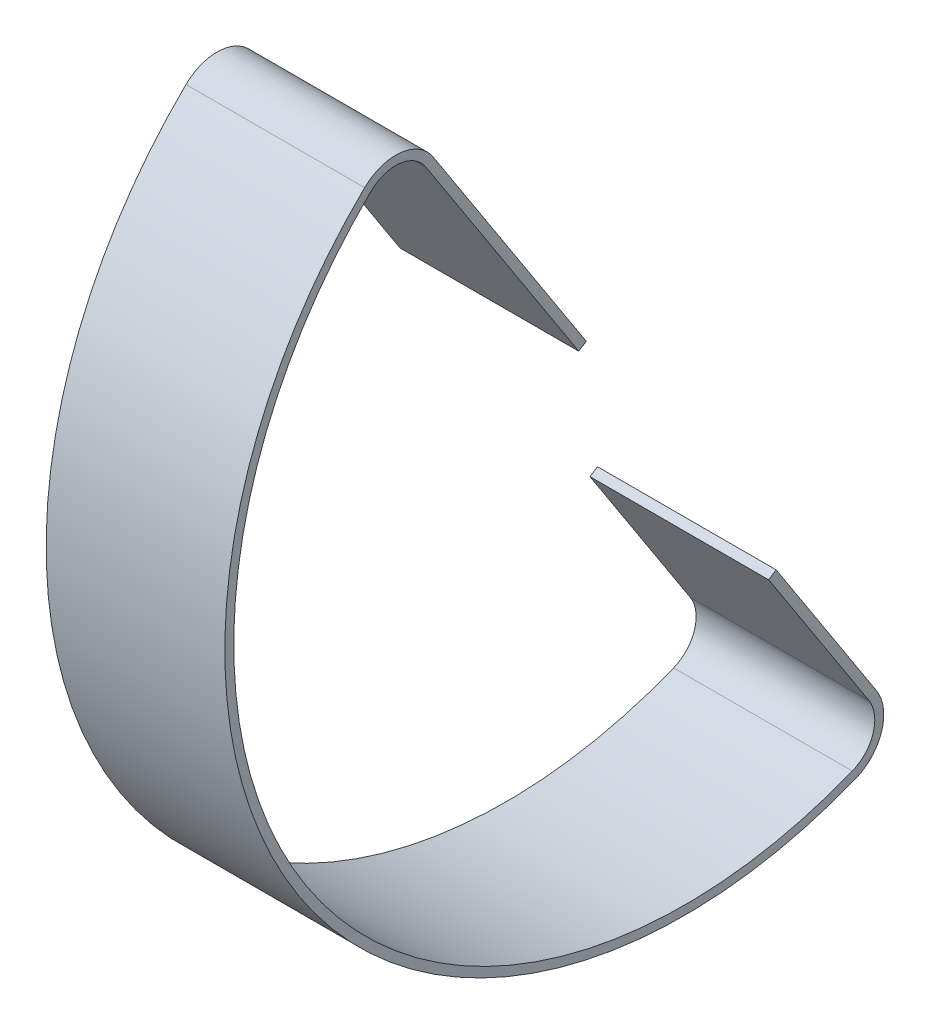
ISO-10303-21;
HEADER;
FILE_DESCRIPTION(('STEP AP214'),'2;1');
FILE_NAME('part.step','',(''),(''),'','','');
FILE_SCHEMA(('AUTOMOTIVE_DESIGN { 1 0 10303 214 1 1 1 1 }'));
ENDSEC;
DATA;
#1=APPLICATION_CONTEXT('core data for automotive mechanical design processes');
#2=APPLICATION_PROTOCOL_DEFINITION('international standard','automotive_design',2000,#1);
#3=PRODUCT_CONTEXT('',#1,'mechanical');
#4=PRODUCT('Part','Part','',(#3));
#5=PRODUCT_RELATED_PRODUCT_CATEGORY('part','',(#4));
#6=PRODUCT_DEFINITION_FORMATION('','',#4);
#7=PRODUCT_DEFINITION_CONTEXT('part definition',#1,'design');
#8=PRODUCT_DEFINITION('design','',#6,#7);
#9=PRODUCT_DEFINITION_SHAPE('','',#8);
#10=(LENGTH_UNIT() NAMED_UNIT(*) SI_UNIT(.MILLI.,.METRE.));
#11=(NAMED_UNIT(*) PLANE_ANGLE_UNIT() SI_UNIT($,.RADIAN.));
#12=(NAMED_UNIT(*) SI_UNIT($,.STERADIAN.) SOLID_ANGLE_UNIT());
#13=UNCERTAINTY_MEASURE_WITH_UNIT(LENGTH_MEASURE(1.E-05),#10,'distance_accuracy_value','');
#14=(GEOMETRIC_REPRESENTATION_CONTEXT(3) GLOBAL_UNCERTAINTY_ASSIGNED_CONTEXT((#13)) GLOBAL_UNIT_ASSIGNED_CONTEXT((#10,
#11,#12)) REPRESENTATION_CONTEXT('',''));
#15=CARTESIAN_POINT('',(0.,0.,0.));
#16=DIRECTION('',(0.,0.,1.));
#17=DIRECTION('',(1.,0.,0.));
#18=AXIS2_PLACEMENT_3D('',#15,#16,#17);
#19=CARTESIAN_POINT('',(2006.6,149.886108079532,-218.334745744563));
#20=DIRECTION('',(0.,0.543974891923004,-0.839101493835732));
#21=DIRECTION('',(0.,0.839101493835732,0.543974891923004));
#22=AXIS2_PLACEMENT_3D('',#19,#20,#21);
#23=PLANE('',#22);
#24=DIRECTION('',(0.,-0.839101493835732,-0.543974891923004));
#25=VECTOR('',#24,1.);
#26=CARTESIAN_POINT('',(1955.8,149.886108079532,-218.334745744563));
#27=LINE('',#26,#25);
#28=CARTESIAN_POINT('',(1955.8,217.012893904773,-174.8176189933));
#29=VERTEX_POINT('',#28);
#30=CARTESIAN_POINT('',(1955.8,149.886108079532,-218.334745744563));
#31=VERTEX_POINT('',#30);
#32=EDGE_CURVE('E161',#29,#31,#27,.T.);
#33=ORIENTED_EDGE('',*,*,#32,.T.);
#34=DIRECTION('',(-1.,0.,0.));
#35=VECTOR('',#34,1.);
#36=CARTESIAN_POINT('',(2006.6,149.886108079532,-218.334745744563));
#37=LINE('',#36,#35);
#38=CARTESIAN_POINT('',(2006.6,149.886108079532,-218.334745744563));
#39=VERTEX_POINT('',#38);
#40=EDGE_CURVE('E11',#39,#31,#37,.T.);
#41=ORIENTED_EDGE('',*,*,#40,.F.);
#42=DIRECTION('',(0.,-0.839101493835732,-0.543974891923004));
#43=VECTOR('',#42,1.);
#44=CARTESIAN_POINT('',(2006.6,149.886108079532,-218.334745744563));
#45=LINE('',#44,#43);
#46=CARTESIAN_POINT('',(2006.6,217.012893904773,-174.8176189933));
#47=VERTEX_POINT('',#46);
#48=EDGE_CURVE('E109',#47,#39,#45,.T.);
#49=ORIENTED_EDGE('',*,*,#48,.F.);
#50=DIRECTION('',(-1.,0.,0.));
#51=VECTOR('',#50,1.);
#52=CARTESIAN_POINT('',(2006.6,217.012893904773,-174.8176189933));
#53=LINE('',#52,#51);
#54=EDGE_CURVE('E157',#47,#29,#53,.T.);
#55=ORIENTED_EDGE('',*,*,#54,.T.);
#56=EDGE_LOOP('',(#33,#41,#49,#55));
#57=FACE_BOUND('',#56,.T.);
#58=ADVANCED_FACE('F41',(#57),#23,.F.);
#59=CARTESIAN_POINT('',(2006.6,151.267804305016,-220.466063538906));
#60=DIRECTION('',(0.,-0.839101493835732,-0.543974891923003));
#61=DIRECTION('',(0.,0.543974891923004,-0.839101493835732));
#62=AXIS2_PLACEMENT_3D('',#59,#60,#61);
#63=PLANE('',#62);
#64=DIRECTION('',(0.,-0.543974891923004,0.839101493835732));
#65=VECTOR('',#64,1.);
#66=CARTESIAN_POINT('',(1955.8,151.267804305016,-220.466063538906));
#67=LINE('',#66,#65);
#68=CARTESIAN_POINT('',(1955.8,151.267804305016,-220.466063538906));
#69=VERTEX_POINT('',#68);
#70=EDGE_CURVE('E164',#69,#31,#67,.T.);
#71=ORIENTED_EDGE('',*,*,#70,.F.);
#72=DIRECTION('',(-1.,0.,0.));
#73=VECTOR('',#72,1.);
#74=CARTESIAN_POINT('',(2006.6,151.267804305016,-220.466063538906));
#75=LINE('',#74,#73);
#76=CARTESIAN_POINT('',(2006.6,151.267804305016,-220.466063538906));
#77=VERTEX_POINT('',#76);
#78=EDGE_CURVE('E49',#77,#69,#75,.T.);
#79=ORIENTED_EDGE('',*,*,#78,.F.);
#80=DIRECTION('',(0.,-0.543974891923004,0.839101493835732));
#81=VECTOR('',#80,1.);
#82=CARTESIAN_POINT('',(2006.6,151.267804305016,-220.466063538906));
#83=LINE('',#82,#81);
#84=EDGE_CURVE('E226',#77,#39,#83,.T.);
#85=ORIENTED_EDGE('',*,*,#84,.T.);
#86=ORIENTED_EDGE('',*,*,#40,.T.);
#87=EDGE_LOOP('',(#71,#79,#85,#86));
#88=FACE_BOUND('',#87,.T.);
#89=ADVANCED_FACE('F213',(#88),#63,.T.);
#90=CARTESIAN_POINT('',(2006.6,151.267804305016,-220.466063538906));
#91=DIRECTION('',(0.,0.543974891923003,-0.839101493835732));
#92=DIRECTION('',(0.,0.839101493835732,0.543974891923004));
#93=AXIS2_PLACEMENT_3D('',#90,#91,#92);
#94=PLANE('',#93);
#95=DIRECTION('',(0.,-0.839101493835732,-0.543974891923004));
#96=VECTOR('',#95,1.);
#97=CARTESIAN_POINT('',(1955.8,151.267804305016,-220.466063538906));
#98=LINE('',#97,#96);
#99=CARTESIAN_POINT('',(1955.8,218.394590130257,-176.948936787643));
#100=VERTEX_POINT('',#99);
#101=EDGE_CURVE('E167',#100,#69,#98,.T.);
#102=ORIENTED_EDGE('',*,*,#101,.F.);
#103=DIRECTION('',(-1.,0.,0.));
#104=VECTOR('',#103,1.);
#105=CARTESIAN_POINT('',(2006.6,218.394590130257,-176.948936787643));
#106=LINE('',#105,#104);
#107=CARTESIAN_POINT('',(2006.6,218.394590130257,-176.948936787643));
#108=VERTEX_POINT('',#107);
#109=EDGE_CURVE('E203',#108,#100,#106,.T.);
#110=ORIENTED_EDGE('',*,*,#109,.F.);
#111=DIRECTION('',(0.,-0.839101493835732,-0.543974891923004));
#112=VECTOR('',#111,1.);
#113=CARTESIAN_POINT('',(2006.6,151.267804305016,-220.466063538906));
#114=LINE('',#113,#112);
#115=EDGE_CURVE('E210',#108,#77,#114,.T.);
#116=ORIENTED_EDGE('',*,*,#115,.T.);
#117=ORIENTED_EDGE('',*,*,#78,.T.);
#118=EDGE_LOOP('',(#102,#110,#116,#117));
#119=FACE_BOUND('',#118,.T.);
#120=ADVANCED_FACE('F208',(#119),#94,.T.);
#121=CARTESIAN_POINT('',(2006.6,211.486109002835,-166.292347815929));
#122=DIRECTION('',(-1.,0.,0.));
#123=DIRECTION('',(0.,0.,1.));
#124=AXIS2_PLACEMENT_3D('',#121,#122,#123);
#125=CYLINDRICAL_SURFACE('',#124,12.7);
#126=CARTESIAN_POINT('',(1955.8,211.486109002835,-166.292347815929));
#127=DIRECTION('',(-1.,0.,0.));
#128=DIRECTION('',(0.,0.,-1.));
#129=AXIS2_PLACEMENT_3D('',#126,#127,#128);
#130=CIRCLE('',#129,12.7);
#131=CARTESIAN_POINT('',(1955.8,220.604709470289,-157.452600901286));
#132=VERTEX_POINT('',#131);
#133=EDGE_CURVE('E170',#132,#100,#130,.T.);
#134=ORIENTED_EDGE('',*,*,#133,.F.);
#135=DIRECTION('',(-1.,0.,0.));
#136=VECTOR('',#135,1.);
#137=CARTESIAN_POINT('',(2006.6,220.604709470289,-157.452600901286));
#138=LINE('',#137,#136);
#139=CARTESIAN_POINT('',(2006.6,220.604709470289,-157.452600901286));
#140=VERTEX_POINT('',#139);
#141=EDGE_CURVE('E201',#140,#132,#138,.T.);
#142=ORIENTED_EDGE('',*,*,#141,.F.);
#143=CARTESIAN_POINT('',(2006.6,211.486109002835,-166.292347815929));
#144=DIRECTION('',(-1.,0.,0.));
#145=DIRECTION('',(0.,0.,-1.));
#146=AXIS2_PLACEMENT_3D('',#143,#144,#145);
#147=CIRCLE('',#146,12.7);
#148=EDGE_CURVE('E223',#140,#108,#147,.T.);
#149=ORIENTED_EDGE('',*,*,#148,.T.);
#150=ORIENTED_EDGE('',*,*,#109,.T.);
#151=EDGE_LOOP('',(#134,#142,#149,#150));
#152=FACE_BOUND('',#151,.T.);
#153=ADVANCED_FACE('F220',(#152),#125,.T.);
#154=CARTESIAN_POINT('',(2006.6,126.694324041268,-248.49113722186));
#155=DIRECTION('',(-1.,0.,0.));
#156=DIRECTION('',(0.,0.,1.));
#157=AXIS2_PLACEMENT_3D('',#154,#155,#156);
#158=CYLINDRICAL_SURFACE('',#157,130.794401970496);
#159=CARTESIAN_POINT('',(1955.8,126.694324041268,-248.49113722186));
#160=DIRECTION('',(-1.,0.,0.));
#161=DIRECTION('',(0.,0.,-1.));
#162=AXIS2_PLACEMENT_3D('',#159,#160,#161);
#163=CIRCLE('',#162,130.794401970496);
#164=CARTESIAN_POINT('',(1955.8,5.25262946196778,-297.061605662341));
#165=VERTEX_POINT('',#164);
#166=EDGE_CURVE('E173',#165,#132,#163,.T.);
#167=ORIENTED_EDGE('',*,*,#166,.F.);
#168=DIRECTION('',(-1.,0.,0.));
#169=VECTOR('',#168,1.);
#170=CARTESIAN_POINT('',(2006.6,5.25262946196778,-297.061605662341));
#171=LINE('',#170,#169);
#172=CARTESIAN_POINT('',(2006.6,5.25262946196778,-297.061605662341));
#173=VERTEX_POINT('',#172);
#174=EDGE_CURVE('E199',#173,#165,#171,.T.);
#175=ORIENTED_EDGE('',*,*,#174,.F.);
#176=CARTESIAN_POINT('',(2006.6,126.694324041268,-248.49113722186));
#177=DIRECTION('',(-1.,0.,0.));
#178=DIRECTION('',(0.,0.,-1.));
#179=AXIS2_PLACEMENT_3D('',#176,#177,#178);
#180=CIRCLE('',#179,130.794401970496);
#181=EDGE_CURVE('E228',#173,#140,#180,.T.);
#182=ORIENTED_EDGE('',*,*,#181,.T.);
#183=ORIENTED_EDGE('',*,*,#141,.T.);
#184=EDGE_LOOP('',(#167,#175,#182,#183));
#185=FACE_BOUND('',#184,.T.);
#186=ADVANCED_FACE('F335',(#185),#158,.T.);
#187=CARTESIAN_POINT('',(2006.6,17.0444913300699,-292.345463840512));
#188=DIRECTION('',(-1.,0.,0.));
#189=DIRECTION('',(0.,0.,1.));
#190=AXIS2_PLACEMENT_3D('',#187,#188,#189);
#191=CYLINDRICAL_SURFACE('',#190,12.7);
#192=CARTESIAN_POINT('',(1955.8,17.0444913300699,-292.345463840512));
#193=DIRECTION('',(-1.,0.,0.));
#194=DIRECTION('',(0.,0.,-1.));
#195=AXIS2_PLACEMENT_3D('',#192,#193,#194);
#196=CIRCLE('',#195,12.7);
#197=CARTESIAN_POINT('',(1955.8,23.9529724574921,-303.002052812226));
#198=VERTEX_POINT('',#197);
#199=EDGE_CURVE('E176',#198,#165,#196,.T.);
#200=ORIENTED_EDGE('',*,*,#199,.F.);
#201=DIRECTION('',(-1.,0.,0.));
#202=VECTOR('',#201,1.);
#203=CARTESIAN_POINT('',(2006.6,23.9529724574921,-303.002052812226));
#204=LINE('',#203,#202);
#205=CARTESIAN_POINT('',(2006.6,23.9529724574921,-303.002052812226));
#206=VERTEX_POINT('',#205);
#207=EDGE_CURVE('E197',#206,#198,#204,.T.);
#208=ORIENTED_EDGE('',*,*,#207,.F.);
#209=CARTESIAN_POINT('',(2006.6,17.0444913300699,-292.345463840512));
#210=DIRECTION('',(-1.,0.,0.));
#211=DIRECTION('',(0.,0.,-1.));
#212=AXIS2_PLACEMENT_3D('',#209,#210,#211);
#213=CIRCLE('',#212,12.7);
#214=EDGE_CURVE('E234',#206,#173,#213,.T.);
#215=ORIENTED_EDGE('',*,*,#214,.T.);
#216=ORIENTED_EDGE('',*,*,#174,.T.);
#217=EDGE_LOOP('',(#200,#208,#215,#216));
#218=FACE_BOUND('',#217,.T.);
#219=ADVANCED_FACE('F325',(#218),#191,.T.);
#220=CARTESIAN_POINT('',(2006.6,67.9873895182371,-274.455306754114));
#221=DIRECTION('',(0.,0.543974891923004,-0.839101493835731));
#222=DIRECTION('',(0.,0.839101493835732,0.543974891923004));
#223=AXIS2_PLACEMENT_3D('',#220,#221,#222);
#224=PLANE('',#223);
#225=DIRECTION('',(0.,-0.839101493835732,-0.543974891923004));
#226=VECTOR('',#225,1.);
#227=CARTESIAN_POINT('',(1955.8,67.9873895182371,-274.455306754114));
#228=LINE('',#227,#226);
#229=CARTESIAN_POINT('',(1955.8,67.9873895182371,-274.455306754114));
#230=VERTEX_POINT('',#229);
#231=EDGE_CURVE('E179',#230,#198,#228,.T.);
#232=ORIENTED_EDGE('',*,*,#231,.F.);
#233=DIRECTION('',(-1.,0.,0.));
#234=VECTOR('',#233,1.);
#235=CARTESIAN_POINT('',(2006.6,67.9873895182371,-274.455306754114));
#236=LINE('',#235,#234);
#237=CARTESIAN_POINT('',(2006.6,67.9873895182371,-274.455306754114));
#238=VERTEX_POINT('',#237);
#239=EDGE_CURVE('E195',#238,#230,#236,.T.);
#240=ORIENTED_EDGE('',*,*,#239,.F.);
#241=DIRECTION('',(0.,-0.839101493835732,-0.543974891923004));
#242=VECTOR('',#241,1.);
#243=CARTESIAN_POINT('',(2006.6,67.9873895182371,-274.455306754114));
#244=LINE('',#243,#242);
#245=EDGE_CURVE('E237',#238,#206,#244,.T.);
#246=ORIENTED_EDGE('',*,*,#245,.T.);
#247=ORIENTED_EDGE('',*,*,#207,.T.);
#248=EDGE_LOOP('',(#232,#240,#246,#247));
#249=FACE_BOUND('',#248,.T.);
#250=ADVANCED_FACE('F249',(#249),#224,.T.);
#251=CARTESIAN_POINT('',(2006.6,66.6056932927527,-272.323988959771));
#252=DIRECTION('',(0.,0.839101493835735,0.543974891922999));
#253=DIRECTION('',(0.,-0.543974891922999,0.839101493835735));
#254=AXIS2_PLACEMENT_3D('',#251,#252,#253);
#255=PLANE('',#254);
#256=DIRECTION('',(0.,0.543974891922999,-0.839101493835735));
#257=VECTOR('',#256,1.);
#258=CARTESIAN_POINT('',(1955.8,66.6056932927527,-272.323988959771));
#259=LINE('',#258,#257);
#260=CARTESIAN_POINT('',(1955.8,66.6056932927527,-272.323988959771));
#261=VERTEX_POINT('',#260);
#262=EDGE_CURVE('E182',#261,#230,#259,.T.);
#263=ORIENTED_EDGE('',*,*,#262,.F.);
#264=DIRECTION('',(-1.,0.,0.));
#265=VECTOR('',#264,1.);
#266=CARTESIAN_POINT('',(2006.6,66.6056932927527,-272.323988959771));
#267=LINE('',#266,#265);
#268=CARTESIAN_POINT('',(2006.6,66.6056932927527,-272.323988959771));
#269=VERTEX_POINT('',#268);
#270=EDGE_CURVE('E193',#269,#261,#267,.T.);
#271=ORIENTED_EDGE('',*,*,#270,.F.);
#272=DIRECTION('',(0.,0.543974891922999,-0.839101493835735));
#273=VECTOR('',#272,1.);
#274=CARTESIAN_POINT('',(2006.6,66.6056932927527,-272.323988959771));
#275=LINE('',#274,#273);
#276=EDGE_CURVE('E240',#269,#238,#275,.T.);
#277=ORIENTED_EDGE('',*,*,#276,.T.);
#278=ORIENTED_EDGE('',*,*,#239,.T.);
#279=EDGE_LOOP('',(#263,#271,#277,#278));
#280=FACE_BOUND('',#279,.T.);
#281=ADVANCED_FACE('F244',(#280),#255,.T.);
#282=CARTESIAN_POINT('',(2006.6,66.6056932927527,-272.323988959771));
#283=DIRECTION('',(0.,0.543974891923004,-0.839101493835731));
#284=DIRECTION('',(0.,0.839101493835732,0.543974891923004));
#285=AXIS2_PLACEMENT_3D('',#282,#283,#284);
#286=PLANE('',#285);
#287=DIRECTION('',(0.,-0.839101493835732,-0.543974891923004));
#288=VECTOR('',#287,1.);
#289=CARTESIAN_POINT('',(1955.8,66.6056932927527,-272.323988959771));
#290=LINE('',#289,#288);
#291=CARTESIAN_POINT('',(1955.8,22.5712762320076,-300.870735017883));
#292=VERTEX_POINT('',#291);
#293=EDGE_CURVE('E185',#261,#292,#290,.T.);
#294=ORIENTED_EDGE('',*,*,#293,.T.);
#295=DIRECTION('',(-1.,0.,0.));
#296=VECTOR('',#295,1.);
#297=CARTESIAN_POINT('',(2006.6,22.5712762320076,-300.870735017883));
#298=LINE('',#297,#296);
#299=CARTESIAN_POINT('',(2006.6,22.5712762320076,-300.870735017883));
#300=VERTEX_POINT('',#299);
#301=EDGE_CURVE('E152',#300,#292,#298,.T.);
#302=ORIENTED_EDGE('',*,*,#301,.F.);
#303=DIRECTION('',(0.,-0.839101493835732,-0.543974891923004));
#304=VECTOR('',#303,1.);
#305=CARTESIAN_POINT('',(2006.6,66.6056932927527,-272.323988959771));
#306=LINE('',#305,#304);
#307=EDGE_CURVE('E143',#269,#300,#306,.T.);
#308=ORIENTED_EDGE('',*,*,#307,.F.);
#309=ORIENTED_EDGE('',*,*,#270,.T.);
#310=EDGE_LOOP('',(#294,#302,#308,#309));
#311=FACE_BOUND('',#310,.T.);
#312=ADVANCED_FACE('F253',(#311),#286,.F.);
#313=CARTESIAN_POINT('',(2006.6,17.0444913300699,-292.345463840512));
#314=DIRECTION('',(-1.,0.,0.));
#315=DIRECTION('',(0.,0.,1.));
#316=AXIS2_PLACEMENT_3D('',#313,#314,#315);
#317=CYLINDRICAL_SURFACE('',#316,10.16);
#318=CARTESIAN_POINT('',(1955.8,17.0444913300699,-292.345463840512));
#319=DIRECTION('',(1.,0.,0.));
#320=DIRECTION('',(0.,0.,-1.));
#321=AXIS2_PLACEMENT_3D('',#318,#319,#320);
#322=CIRCLE('',#321,10.16);
#323=CARTESIAN_POINT('',(1955.8,7.61100183558819,-296.118377297975));
#324=VERTEX_POINT('',#323);
#325=EDGE_CURVE('E151',#292,#324,#322,.F.);
#326=ORIENTED_EDGE('',*,*,#325,.T.);
#327=DIRECTION('',(-1.,0.,0.));
#328=VECTOR('',#327,1.);
#329=CARTESIAN_POINT('',(2006.6,7.61100183558819,-296.118377297975));
#330=LINE('',#329,#328);
#331=CARTESIAN_POINT('',(2006.6,7.61100183558819,-296.118377297975));
#332=VERTEX_POINT('',#331);
#333=EDGE_CURVE('E148',#332,#324,#330,.T.);
#334=ORIENTED_EDGE('',*,*,#333,.F.);
#335=CARTESIAN_POINT('',(2006.6,17.0444913300699,-292.345463840512));
#336=DIRECTION('',(1.,0.,0.));
#337=DIRECTION('',(0.,0.,-1.));
#338=AXIS2_PLACEMENT_3D('',#335,#336,#337);
#339=CIRCLE('',#338,10.16);
#340=EDGE_CURVE('E136',#300,#332,#339,.F.);
#341=ORIENTED_EDGE('',*,*,#340,.F.);
#342=ORIENTED_EDGE('',*,*,#301,.T.);
#343=EDGE_LOOP('',(#326,#334,#341,#342));
#344=FACE_BOUND('',#343,.T.);
#345=ADVANCED_FACE('F149',(#344),#317,.F.);
#346=CARTESIAN_POINT('',(2006.6,126.694324041268,-248.49113722186));
#347=DIRECTION('',(-1.,0.,0.));
#348=DIRECTION('',(0.,0.,1.));
#349=AXIS2_PLACEMENT_3D('',#346,#347,#348);
#350=CYLINDRICAL_SURFACE('',#349,128.254401970496);
#351=CARTESIAN_POINT('',(1955.8,126.694324041268,-248.49113722186));
#352=DIRECTION('',(1.,0.,0.));
#353=DIRECTION('',(0.,0.,-1.));
#354=AXIS2_PLACEMENT_3D('',#351,#352,#353);
#355=CIRCLE('',#354,128.254401970496);
#356=CARTESIAN_POINT('',(1955.8,218.780989376798,-159.220550284215));
#357=VERTEX_POINT('',#356);
#358=EDGE_CURVE('E97',#324,#357,#355,.F.);
#359=ORIENTED_EDGE('',*,*,#358,.T.);
#360=DIRECTION('',(-1.,0.,0.));
#361=VECTOR('',#360,1.);
#362=CARTESIAN_POINT('',(2006.6,218.780989376798,-159.220550284215));
#363=LINE('',#362,#361);
#364=CARTESIAN_POINT('',(2006.6,218.780989376798,-159.220550284215));
#365=VERTEX_POINT('',#364);
#366=EDGE_CURVE('E153',#365,#357,#363,.T.);
#367=ORIENTED_EDGE('',*,*,#366,.F.);
#368=CARTESIAN_POINT('',(2006.6,126.694324041268,-248.49113722186));
#369=DIRECTION('',(1.,0.,0.));
#370=DIRECTION('',(0.,0.,-1.));
#371=AXIS2_PLACEMENT_3D('',#368,#369,#370);
#372=CIRCLE('',#371,128.254401970496);
#373=EDGE_CURVE('E140',#332,#365,#372,.F.);
#374=ORIENTED_EDGE('',*,*,#373,.F.);
#375=ORIENTED_EDGE('',*,*,#333,.T.);
#376=EDGE_LOOP('',(#359,#367,#374,#375));
#377=FACE_BOUND('',#376,.T.);
#378=ADVANCED_FACE('F155',(#377),#350,.F.);
#379=CARTESIAN_POINT('',(2006.6,211.486109002835,-166.292347815929));
#380=DIRECTION('',(-1.,0.,0.));
#381=DIRECTION('',(0.,0.,1.));
#382=AXIS2_PLACEMENT_3D('',#379,#380,#381);
#383=CYLINDRICAL_SURFACE('',#382,10.16);
#384=CARTESIAN_POINT('',(1955.8,211.486109002835,-166.292347815929));
#385=DIRECTION('',(1.,0.,0.));
#386=DIRECTION('',(0.,0.,-1.));
#387=AXIS2_PLACEMENT_3D('',#384,#385,#386);
#388=CIRCLE('',#387,10.16);
#389=EDGE_CURVE('E103',#357,#29,#388,.F.);
#390=ORIENTED_EDGE('',*,*,#389,.T.);
#391=ORIENTED_EDGE('',*,*,#54,.F.);
#392=CARTESIAN_POINT('',(2006.6,211.486109002835,-166.292347815929));
#393=DIRECTION('',(1.,0.,0.));
#394=DIRECTION('',(0.,0.,-1.));
#395=AXIS2_PLACEMENT_3D('',#392,#393,#394);
#396=CIRCLE('',#395,10.16);
#397=EDGE_CURVE('E57',#365,#47,#396,.F.);
#398=ORIENTED_EDGE('',*,*,#397,.F.);
#399=ORIENTED_EDGE('',*,*,#366,.T.);
#400=EDGE_LOOP('',(#390,#391,#398,#399));
#401=FACE_BOUND('',#400,.T.);
#402=ADVANCED_FACE('F267',(#401),#383,.F.);
#403=CARTESIAN_POINT('',(2006.6,211.486109002835,-166.292347815929));
#404=DIRECTION('',(-1.,0.,0.));
#405=DIRECTION('',(0.,0.,1.));
#406=AXIS2_PLACEMENT_3D('',#403,#404,#405);
#407=PLANE('',#406);
#408=ORIENTED_EDGE('',*,*,#48,.T.);
#409=ORIENTED_EDGE('',*,*,#84,.F.);
#410=ORIENTED_EDGE('',*,*,#115,.F.);
#411=ORIENTED_EDGE('',*,*,#148,.F.);
#412=ORIENTED_EDGE('',*,*,#181,.F.);
#413=ORIENTED_EDGE('',*,*,#214,.F.);
#414=ORIENTED_EDGE('',*,*,#245,.F.);
#415=ORIENTED_EDGE('',*,*,#276,.F.);
#416=ORIENTED_EDGE('',*,*,#307,.T.);
#417=ORIENTED_EDGE('',*,*,#340,.T.);
#418=ORIENTED_EDGE('',*,*,#373,.T.);
#419=ORIENTED_EDGE('',*,*,#397,.T.);
#420=EDGE_LOOP('',(#408,#409,#410,#411,#412,#413,#414,#415,#416,#417,#418,#419));
#421=FACE_BOUND('',#420,.T.);
#422=ADVANCED_FACE('F138',(#421),#407,.F.);
#423=CARTESIAN_POINT('',(1955.8,211.486109002835,-166.292347815929));
#424=DIRECTION('',(-1.,0.,0.));
#425=DIRECTION('',(0.,0.,1.));
#426=AXIS2_PLACEMENT_3D('',#423,#424,#425);
#427=PLANE('',#426);
#428=ORIENTED_EDGE('',*,*,#32,.F.);
#429=ORIENTED_EDGE('',*,*,#389,.F.);
#430=ORIENTED_EDGE('',*,*,#358,.F.);
#431=ORIENTED_EDGE('',*,*,#325,.F.);
#432=ORIENTED_EDGE('',*,*,#293,.F.);
#433=ORIENTED_EDGE('',*,*,#262,.T.);
#434=ORIENTED_EDGE('',*,*,#231,.T.);
#435=ORIENTED_EDGE('',*,*,#199,.T.);
#436=ORIENTED_EDGE('',*,*,#166,.T.);
#437=ORIENTED_EDGE('',*,*,#133,.T.);
#438=ORIENTED_EDGE('',*,*,#101,.T.);
#439=ORIENTED_EDGE('',*,*,#70,.T.);
#440=EDGE_LOOP('',(#428,#429,#430,#431,#432,#433,#434,#435,#436,#437,#438,#439));
#441=FACE_BOUND('',#440,.T.);
#442=ADVANCED_FACE('F216',(#441),#427,.T.);
#443=CLOSED_SHELL('',(#58,#89,#120,#153,#186,#219,#250,#281,#312,#345,#378,#402,#422,#442));
#444=MANIFOLD_SOLID_BREP('B2',#443);
#445=ADVANCED_BREP_SHAPE_REPRESENTATION('',(#18,#444),#14);
#446=SHAPE_DEFINITION_REPRESENTATION(#9,#445);
ENDSEC;
END-ISO-10303-21;
